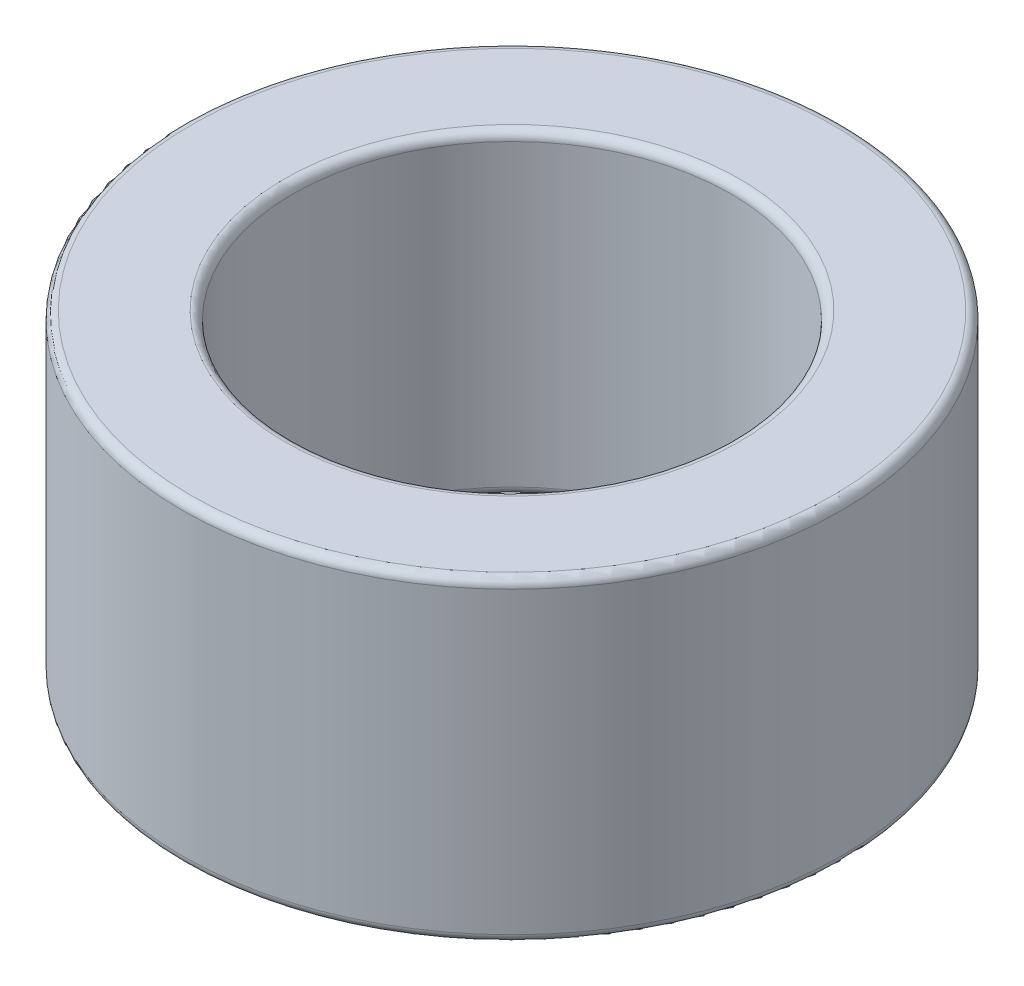
ISO-10303-21;
HEADER;
FILE_DESCRIPTION(('STEP AP214'),'2;1');
FILE_NAME('part.step','',(''),(''),'','','');
FILE_SCHEMA(('AUTOMOTIVE_DESIGN { 1 0 10303 214 1 1 1 1 }'));
ENDSEC;
DATA;
#1=APPLICATION_CONTEXT('core data for automotive mechanical design processes');
#2=APPLICATION_PROTOCOL_DEFINITION('international standard','automotive_design',2000,#1);
#3=PRODUCT_CONTEXT('',#1,'mechanical');
#4=PRODUCT('Part','Part','',(#3));
#5=PRODUCT_RELATED_PRODUCT_CATEGORY('part','',(#4));
#6=PRODUCT_DEFINITION_FORMATION('','',#4);
#7=PRODUCT_DEFINITION_CONTEXT('part definition',#1,'design');
#8=PRODUCT_DEFINITION('design','',#6,#7);
#9=PRODUCT_DEFINITION_SHAPE('','',#8);
#10=(LENGTH_UNIT() NAMED_UNIT(*) SI_UNIT(.MILLI.,.METRE.));
#11=(NAMED_UNIT(*) PLANE_ANGLE_UNIT() SI_UNIT($,.RADIAN.));
#12=(NAMED_UNIT(*) SI_UNIT($,.STERADIAN.) SOLID_ANGLE_UNIT());
#13=UNCERTAINTY_MEASURE_WITH_UNIT(LENGTH_MEASURE(1.E-05),#10,'distance_accuracy_value','');
#14=(GEOMETRIC_REPRESENTATION_CONTEXT(3) GLOBAL_UNCERTAINTY_ASSIGNED_CONTEXT((#13)) GLOBAL_UNIT_ASSIGNED_CONTEXT((#10,
#11,#12)) REPRESENTATION_CONTEXT('',''));
#15=CARTESIAN_POINT('',(0.,0.,0.));
#16=DIRECTION('',(0.,0.,1.));
#17=DIRECTION('',(1.,0.,0.));
#18=AXIS2_PLACEMENT_3D('',#15,#16,#17);
#19=CARTESIAN_POINT('',(0.,3.65,0.));
#20=DIRECTION('',(0.,1.,0.));
#21=DIRECTION('',(0.,0.,1.));
#22=AXIS2_PLACEMENT_3D('',#19,#20,#21);
#23=PLANE('',#22);
#24=CARTESIAN_POINT('',(0.,3.65,0.));
#25=DIRECTION('',(0.,1.,0.));
#26=DIRECTION('',(0.,0.,1.));
#27=AXIS2_PLACEMENT_3D('',#24,#25,#26);
#28=CIRCLE('',#27,2.625);
#29=CARTESIAN_POINT('',(0.,3.65,2.625));
#30=VERTEX_POINT('',#29);
#31=EDGE_CURVE('E10',#30,#30,#28,.F.);
#32=ORIENTED_EDGE('',*,*,#31,.T.);
#33=EDGE_LOOP('',(#32));
#34=FACE_BOUND('',#33,.T.);
#35=CARTESIAN_POINT('',(0.,3.65,0.));
#36=DIRECTION('',(0.,1.,0.));
#37=DIRECTION('',(0.,0.,1.));
#38=AXIS2_PLACEMENT_3D('',#35,#36,#37);
#39=CIRCLE('',#38,3.7);
#40=CARTESIAN_POINT('',(0.,3.65,3.7));
#41=VERTEX_POINT('',#40);
#42=EDGE_CURVE('E39',#41,#41,#39,.T.);
#43=ORIENTED_EDGE('',*,*,#42,.T.);
#44=EDGE_LOOP('',(#43));
#45=FACE_BOUND('',#44,.T.);
#46=ADVANCED_FACE('F32',(#34,#45),#23,.T.);
#47=CARTESIAN_POINT('',(0.,0.,0.));
#48=DIRECTION('',(0.,1.,0.));
#49=DIRECTION('',(0.,0.,1.));
#50=AXIS2_PLACEMENT_3D('',#47,#48,#49);
#51=PLANE('',#50);
#52=CARTESIAN_POINT('',(0.,0.,0.));
#53=DIRECTION('',(0.,1.,0.));
#54=DIRECTION('',(0.,0.,1.));
#55=AXIS2_PLACEMENT_3D('',#52,#53,#54);
#56=CIRCLE('',#55,2.625);
#57=CARTESIAN_POINT('',(0.,0.,2.625));
#58=VERTEX_POINT('',#57);
#59=EDGE_CURVE('E58',#58,#58,#56,.T.);
#60=ORIENTED_EDGE('',*,*,#59,.T.);
#61=EDGE_LOOP('',(#60));
#62=FACE_BOUND('',#61,.T.);
#63=CARTESIAN_POINT('',(0.,0.,0.));
#64=DIRECTION('',(0.,1.,0.));
#65=DIRECTION('',(0.,0.,1.));
#66=AXIS2_PLACEMENT_3D('',#63,#64,#65);
#67=CIRCLE('',#66,3.7);
#68=CARTESIAN_POINT('',(0.,0.,3.7));
#69=VERTEX_POINT('',#68);
#70=EDGE_CURVE('E61',#69,#69,#67,.F.);
#71=ORIENTED_EDGE('',*,*,#70,.T.);
#72=EDGE_LOOP('',(#71));
#73=FACE_BOUND('',#72,.T.);
#74=ADVANCED_FACE('F65',(#62,#73),#51,.F.);
#75=CARTESIAN_POINT('',(0.,3.65,0.));
#76=DIRECTION('',(0.,-1.,0.));
#77=DIRECTION('',(0.,0.,-1.));
#78=AXIS2_PLACEMENT_3D('',#75,#76,#77);
#79=CYLINDRICAL_SURFACE('',#78,3.8);
#80=CARTESIAN_POINT('',(0.,0.0999999999999998,0.));
#81=DIRECTION('',(0.,1.,0.));
#82=DIRECTION('',(0.,0.,1.));
#83=AXIS2_PLACEMENT_3D('',#80,#81,#82);
#84=CIRCLE('',#83,3.8);
#85=CARTESIAN_POINT('',(0.,0.0999999999999998,3.8));
#86=VERTEX_POINT('',#85);
#87=EDGE_CURVE('E43',#86,#86,#84,.T.);
#88=ORIENTED_EDGE('',*,*,#87,.T.);
#89=EDGE_LOOP('',(#88));
#90=FACE_BOUND('',#89,.T.);
#91=CARTESIAN_POINT('',(0.,3.55,0.));
#92=DIRECTION('',(0.,1.,0.));
#93=DIRECTION('',(0.,0.,1.));
#94=AXIS2_PLACEMENT_3D('',#91,#92,#93);
#95=CIRCLE('',#94,3.8);
#96=CARTESIAN_POINT('',(0.,3.55,3.8));
#97=VERTEX_POINT('',#96);
#98=EDGE_CURVE('E47',#97,#97,#95,.F.);
#99=ORIENTED_EDGE('',*,*,#98,.T.);
#100=EDGE_LOOP('',(#99));
#101=FACE_BOUND('',#100,.T.);
#102=ADVANCED_FACE('F75',(#90,#101),#79,.T.);
#103=CARTESIAN_POINT('',(0.,3.65,0.));
#104=DIRECTION('',(0.,-1.,0.));
#105=DIRECTION('',(0.,0.,-1.));
#106=AXIS2_PLACEMENT_3D('',#103,#104,#105);
#107=CYLINDRICAL_SURFACE('',#106,2.525);
#108=CARTESIAN_POINT('',(0.,0.0999999999999998,0.));
#109=DIRECTION('',(0.,1.,0.));
#110=DIRECTION('',(0.,0.,1.));
#111=AXIS2_PLACEMENT_3D('',#108,#109,#110);
#112=CIRCLE('',#111,2.525);
#113=CARTESIAN_POINT('',(0.,0.0999999999999998,2.525));
#114=VERTEX_POINT('',#113);
#115=EDGE_CURVE('E52',#114,#114,#112,.F.);
#116=ORIENTED_EDGE('',*,*,#115,.T.);
#117=EDGE_LOOP('',(#116));
#118=FACE_BOUND('',#117,.T.);
#119=CARTESIAN_POINT('',(0.,3.55,0.));
#120=DIRECTION('',(0.,1.,0.));
#121=DIRECTION('',(0.,0.,1.));
#122=AXIS2_PLACEMENT_3D('',#119,#120,#121);
#123=CIRCLE('',#122,2.525);
#124=CARTESIAN_POINT('',(0.,3.55,2.525));
#125=VERTEX_POINT('',#124);
#126=EDGE_CURVE('E55',#125,#125,#123,.T.);
#127=ORIENTED_EDGE('',*,*,#126,.T.);
#128=EDGE_LOOP('',(#127));
#129=FACE_BOUND('',#128,.T.);
#130=ADVANCED_FACE('F78',(#118,#129),#107,.F.);
#131=CARTESIAN_POINT('',(0.,0.0999999999999998,0.));
#132=DIRECTION('',(0.,1.,0.));
#133=DIRECTION('',(0.,0.,1.));
#134=AXIS2_PLACEMENT_3D('',#131,#132,#133);
#135=TOROIDAL_SURFACE('',#134,2.625,0.1);
#136=ORIENTED_EDGE('',*,*,#115,.F.);
#137=EDGE_LOOP('',(#136));
#138=FACE_BOUND('',#137,.T.);
#139=ORIENTED_EDGE('',*,*,#59,.F.);
#140=EDGE_LOOP('',(#139));
#141=FACE_BOUND('',#140,.T.);
#142=ADVANCED_FACE('F71',(#138,#141),#135,.T.);
#143=CARTESIAN_POINT('',(0.,0.0999999999999998,0.));
#144=DIRECTION('',(0.,1.,0.));
#145=DIRECTION('',(0.,0.,1.));
#146=AXIS2_PLACEMENT_3D('',#143,#144,#145);
#147=TOROIDAL_SURFACE('',#146,3.7,0.1);
#148=ORIENTED_EDGE('',*,*,#70,.F.);
#149=EDGE_LOOP('',(#148));
#150=FACE_BOUND('',#149,.T.);
#151=ORIENTED_EDGE('',*,*,#87,.F.);
#152=EDGE_LOOP('',(#151));
#153=FACE_BOUND('',#152,.T.);
#154=ADVANCED_FACE('F67',(#150,#153),#147,.T.);
#155=CARTESIAN_POINT('',(0.,3.55,0.));
#156=DIRECTION('',(0.,1.,0.));
#157=DIRECTION('',(0.,0.,1.));
#158=AXIS2_PLACEMENT_3D('',#155,#156,#157);
#159=TOROIDAL_SURFACE('',#158,2.625,0.1);
#160=ORIENTED_EDGE('',*,*,#31,.F.);
#161=EDGE_LOOP('',(#160));
#162=FACE_BOUND('',#161,.T.);
#163=ORIENTED_EDGE('',*,*,#126,.F.);
#164=EDGE_LOOP('',(#163));
#165=FACE_BOUND('',#164,.T.);
#166=ADVANCED_FACE('F70',(#162,#165),#159,.T.);
#167=CARTESIAN_POINT('',(0.,3.55,0.));
#168=DIRECTION('',(0.,1.,0.));
#169=DIRECTION('',(0.,0.,1.));
#170=AXIS2_PLACEMENT_3D('',#167,#168,#169);
#171=TOROIDAL_SURFACE('',#170,3.7,0.1);
#172=ORIENTED_EDGE('',*,*,#98,.F.);
#173=EDGE_LOOP('',(#172));
#174=FACE_BOUND('',#173,.T.);
#175=ORIENTED_EDGE('',*,*,#42,.F.);
#176=EDGE_LOOP('',(#175));
#177=FACE_BOUND('',#176,.T.);
#178=ADVANCED_FACE('F34',(#174,#177),#171,.T.);
#179=CLOSED_SHELL('',(#46,#74,#102,#130,#142,#154,#166,#178));
#180=MANIFOLD_SOLID_BREP('B2',#179);
#181=ADVANCED_BREP_SHAPE_REPRESENTATION('',(#18,#180),#14);
#182=SHAPE_DEFINITION_REPRESENTATION(#9,#181);
ENDSEC;
END-ISO-10303-21;
